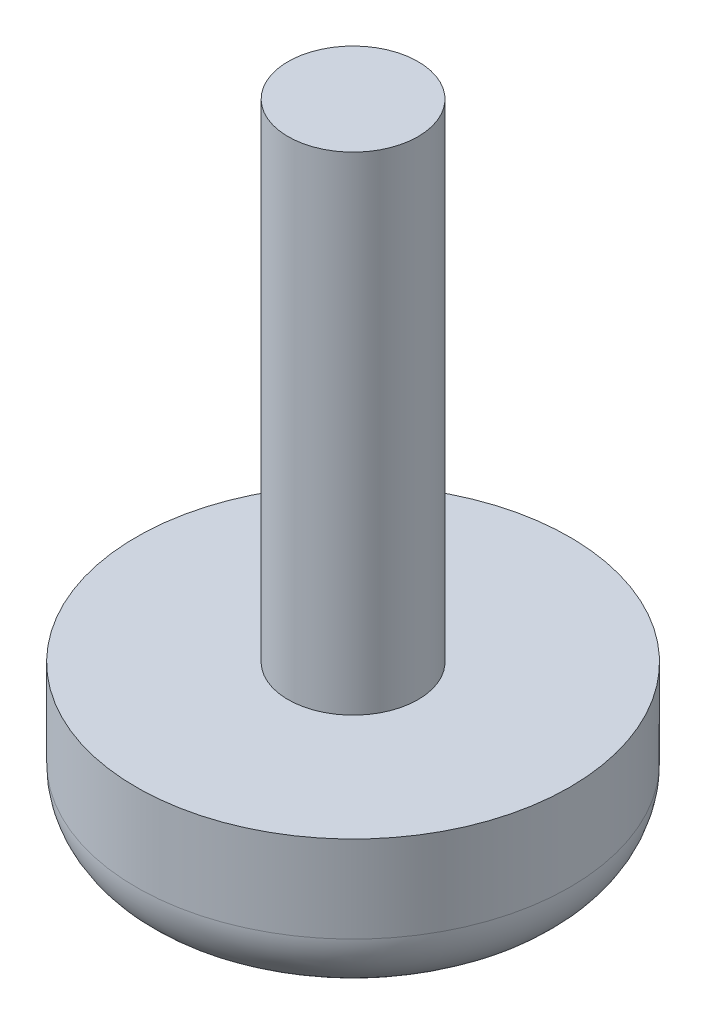
ISO-10303-21;
HEADER;
FILE_DESCRIPTION(('STEP AP214'),'2;1');
FILE_NAME('part.step','',(''),(''),'','','');
FILE_SCHEMA(('AUTOMOTIVE_DESIGN { 1 0 10303 214 1 1 1 1 }'));
ENDSEC;
DATA;
#1=APPLICATION_CONTEXT('core data for automotive mechanical design processes');
#2=APPLICATION_PROTOCOL_DEFINITION('international standard','automotive_design',2000,#1);
#3=PRODUCT_CONTEXT('',#1,'mechanical');
#4=PRODUCT('Part','Part','',(#3));
#5=PRODUCT_RELATED_PRODUCT_CATEGORY('part','',(#4));
#6=PRODUCT_DEFINITION_FORMATION('','',#4);
#7=PRODUCT_DEFINITION_CONTEXT('part definition',#1,'design');
#8=PRODUCT_DEFINITION('design','',#6,#7);
#9=PRODUCT_DEFINITION_SHAPE('','',#8);
#10=(LENGTH_UNIT() NAMED_UNIT(*) SI_UNIT(.MILLI.,.METRE.));
#11=(NAMED_UNIT(*) PLANE_ANGLE_UNIT() SI_UNIT($,.RADIAN.));
#12=(NAMED_UNIT(*) SI_UNIT($,.STERADIAN.) SOLID_ANGLE_UNIT());
#13=UNCERTAINTY_MEASURE_WITH_UNIT(LENGTH_MEASURE(1.E-05),#10,'distance_accuracy_value','');
#14=(GEOMETRIC_REPRESENTATION_CONTEXT(3) GLOBAL_UNCERTAINTY_ASSIGNED_CONTEXT((#13)) GLOBAL_UNIT_ASSIGNED_CONTEXT((#10,
#11,#12)) REPRESENTATION_CONTEXT('',''));
#15=CARTESIAN_POINT('',(0.,0.,0.));
#16=DIRECTION('',(0.,0.,1.));
#17=DIRECTION('',(1.,0.,0.));
#18=AXIS2_PLACEMENT_3D('',#15,#16,#17);
#19=CARTESIAN_POINT('',(0.,-7.,0.));
#20=DIRECTION('',(0.,-1.,0.));
#21=DIRECTION('',(1.,0.,0.));
#22=AXIS2_PLACEMENT_3D('',#19,#20,#21);
#23=PLANE('',#22);
#24=CARTESIAN_POINT('',(0.,-7.,0.));
#25=DIRECTION('',(0.,-1.,0.));
#26=DIRECTION('',(1.,0.,0.));
#27=AXIS2_PLACEMENT_3D('',#24,#25,#26);
#28=CIRCLE('',#27,7.);
#29=CARTESIAN_POINT('',(7.,-7.,0.));
#30=VERTEX_POINT('',#29);
#31=EDGE_CURVE('E54',#30,#30,#28,.T.);
#32=ORIENTED_EDGE('',*,*,#31,.T.);
#33=EDGE_LOOP('',(#32));
#34=FACE_BOUND('',#33,.T.);
#35=ADVANCED_FACE('F47',(#34),#23,.T.);
#36=CARTESIAN_POINT('',(0.,0.,0.));
#37=DIRECTION('',(0.,-1.,0.));
#38=DIRECTION('',(1.,0.,0.));
#39=AXIS2_PLACEMENT_3D('',#36,#37,#38);
#40=CYLINDRICAL_SURFACE('',#39,10.);
#41=CARTESIAN_POINT('',(0.,-4.,0.));
#42=DIRECTION('',(0.,-1.,0.));
#43=DIRECTION('',(1.,0.,0.));
#44=AXIS2_PLACEMENT_3D('',#41,#42,#43);
#45=CIRCLE('',#44,10.);
#46=CARTESIAN_POINT('',(10.,-4.,0.));
#47=VERTEX_POINT('',#46);
#48=EDGE_CURVE('E10',#47,#47,#45,.F.);
#49=ORIENTED_EDGE('',*,*,#48,.T.);
#50=EDGE_LOOP('',(#49));
#51=FACE_BOUND('',#50,.T.);
#52=CARTESIAN_POINT('',(0.,0.,0.));
#53=DIRECTION('',(0.,-1.,0.));
#54=DIRECTION('',(1.,0.,0.));
#55=AXIS2_PLACEMENT_3D('',#52,#53,#54);
#56=CIRCLE('',#55,10.);
#57=CARTESIAN_POINT('',(10.,0.,0.));
#58=VERTEX_POINT('',#57);
#59=EDGE_CURVE('E62',#58,#58,#56,.T.);
#60=ORIENTED_EDGE('',*,*,#59,.T.);
#61=EDGE_LOOP('',(#60));
#62=FACE_BOUND('',#61,.T.);
#63=ADVANCED_FACE('F71',(#51,#62),#40,.T.);
#64=CARTESIAN_POINT('',(0.,0.,0.));
#65=DIRECTION('',(0.,-1.,0.));
#66=DIRECTION('',(1.,0.,0.));
#67=AXIS2_PLACEMENT_3D('',#64,#65,#66);
#68=PLANE('',#67);
#69=CARTESIAN_POINT('',(0.,0.,0.));
#70=DIRECTION('',(0.,-1.,0.));
#71=DIRECTION('',(1.,0.,0.));
#72=AXIS2_PLACEMENT_3D('',#69,#70,#71);
#73=CIRCLE('',#72,3.);
#74=CARTESIAN_POINT('',(3.,0.,0.));
#75=VERTEX_POINT('',#74);
#76=EDGE_CURVE('E58',#75,#75,#73,.T.);
#77=ORIENTED_EDGE('',*,*,#76,.T.);
#78=EDGE_LOOP('',(#77));
#79=FACE_BOUND('',#78,.T.);
#80=ORIENTED_EDGE('',*,*,#59,.F.);
#81=EDGE_LOOP('',(#80));
#82=FACE_BOUND('',#81,.T.);
#83=ADVANCED_FACE('F73',(#79,#82),#68,.F.);
#84=CARTESIAN_POINT('',(0.,22.5,0.));
#85=DIRECTION('',(0.,-1.,0.));
#86=DIRECTION('',(1.,0.,0.));
#87=AXIS2_PLACEMENT_3D('',#84,#85,#86);
#88=PLANE('',#87);
#89=CARTESIAN_POINT('',(0.,22.5,0.));
#90=DIRECTION('',(0.,-1.,0.));
#91=DIRECTION('',(1.,0.,0.));
#92=AXIS2_PLACEMENT_3D('',#89,#90,#91);
#93=CIRCLE('',#92,3.);
#94=CARTESIAN_POINT('',(3.,22.5,0.));
#95=VERTEX_POINT('',#94);
#96=EDGE_CURVE('E65',#95,#95,#93,.T.);
#97=ORIENTED_EDGE('',*,*,#96,.F.);
#98=EDGE_LOOP('',(#97));
#99=FACE_BOUND('',#98,.T.);
#100=ADVANCED_FACE('F75',(#99),#88,.F.);
#101=CARTESIAN_POINT('',(0.,0.,0.));
#102=DIRECTION('',(0.,-1.,0.));
#103=DIRECTION('',(1.,0.,0.));
#104=AXIS2_PLACEMENT_3D('',#101,#102,#103);
#105=CYLINDRICAL_SURFACE('',#104,3.);
#106=ORIENTED_EDGE('',*,*,#96,.T.);
#107=EDGE_LOOP('',(#106));
#108=FACE_BOUND('',#107,.T.);
#109=ORIENTED_EDGE('',*,*,#76,.F.);
#110=EDGE_LOOP('',(#109));
#111=FACE_BOUND('',#110,.T.);
#112=ADVANCED_FACE('F78',(#108,#111),#105,.T.);
#113=CARTESIAN_POINT('',(0.,-4.,0.));
#114=DIRECTION('',(0.,-1.,0.));
#115=DIRECTION('',(1.,0.,0.));
#116=AXIS2_PLACEMENT_3D('',#113,#114,#115);
#117=TOROIDAL_SURFACE('',#116,7.,3.);
#118=ORIENTED_EDGE('',*,*,#48,.F.);
#119=EDGE_LOOP('',(#118));
#120=FACE_BOUND('',#119,.T.);
#121=ORIENTED_EDGE('',*,*,#31,.F.);
#122=EDGE_LOOP('',(#121));
#123=FACE_BOUND('',#122,.T.);
#124=ADVANCED_FACE('F49',(#120,#123),#117,.T.);
#125=CLOSED_SHELL('',(#35,#63,#83,#100,#112,#124));
#126=MANIFOLD_SOLID_BREP('B2',#125);
#127=ADVANCED_BREP_SHAPE_REPRESENTATION('',(#18,#126),#14);
#128=SHAPE_DEFINITION_REPRESENTATION(#9,#127);
ENDSEC;
END-ISO-10303-21;
